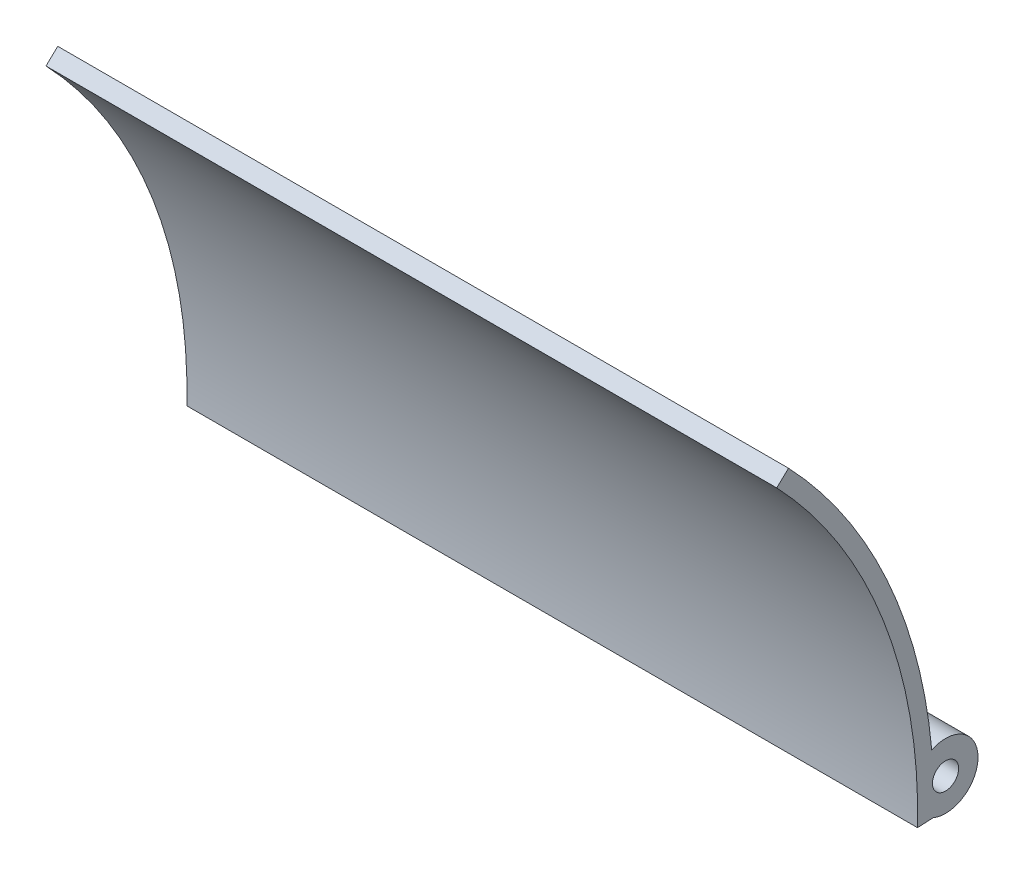
ISO-10303-21;
HEADER;
FILE_DESCRIPTION(('STEP AP214'),'2;1');
FILE_NAME('part.step','',(''),(''),'','','');
FILE_SCHEMA(('AUTOMOTIVE_DESIGN { 1 0 10303 214 1 1 1 1 }'));
ENDSEC;
DATA;
#1=APPLICATION_CONTEXT('core data for automotive mechanical design processes');
#2=APPLICATION_PROTOCOL_DEFINITION('international standard','automotive_design',2000,#1);
#3=PRODUCT_CONTEXT('',#1,'mechanical');
#4=PRODUCT('Part','Part','',(#3));
#5=PRODUCT_RELATED_PRODUCT_CATEGORY('part','',(#4));
#6=PRODUCT_DEFINITION_FORMATION('','',#4);
#7=PRODUCT_DEFINITION_CONTEXT('part definition',#1,'design');
#8=PRODUCT_DEFINITION('design','',#6,#7);
#9=PRODUCT_DEFINITION_SHAPE('','',#8);
#10=(LENGTH_UNIT() NAMED_UNIT(*) SI_UNIT(.MILLI.,.METRE.));
#11=(NAMED_UNIT(*) PLANE_ANGLE_UNIT() SI_UNIT($,.RADIAN.));
#12=(NAMED_UNIT(*) SI_UNIT($,.STERADIAN.) SOLID_ANGLE_UNIT());
#13=UNCERTAINTY_MEASURE_WITH_UNIT(LENGTH_MEASURE(1.E-05),#10,'distance_accuracy_value','');
#14=(GEOMETRIC_REPRESENTATION_CONTEXT(3) GLOBAL_UNCERTAINTY_ASSIGNED_CONTEXT((#13)) GLOBAL_UNIT_ASSIGNED_CONTEXT((#10,
#11,#12)) REPRESENTATION_CONTEXT('',''));
#15=CARTESIAN_POINT('',(0.,0.,0.));
#16=DIRECTION('',(0.,0.,1.));
#17=DIRECTION('',(1.,0.,0.));
#18=AXIS2_PLACEMENT_3D('',#15,#16,#17);
#19=CARTESIAN_POINT('',(180.,0.,0.));
#20=DIRECTION('',(1.,0.,0.));
#21=DIRECTION('',(0.,0.,-1.));
#22=AXIS2_PLACEMENT_3D('',#19,#20,#21);
#23=PLANE('',#22);
#24=CARTESIAN_POINT('',(180.,0.,0.));
#25=DIRECTION('',(-1.,0.,0.));
#26=DIRECTION('',(0.,0.,-1.));
#27=AXIS2_PLACEMENT_3D('',#24,#25,#26);
#28=CIRCLE('',#27,125.8);
#29=CARTESIAN_POINT('',(180.,86.7682376149053,-91.0873917795616));
#30=VERTEX_POINT('',#29);
#31=CARTESIAN_POINT('',(180.,-3.05410319881889,-125.762921617029));
#32=VERTEX_POINT('',#31);
#33=EDGE_CURVE('E124',#30,#32,#28,.T.);
#34=ORIENTED_EDGE('',*,*,#33,.T.);
#35=DIRECTION('',(0.,0.0502963955042818,-0.99873433534613));
#36=VECTOR('',#35,1.);
#37=CARTESIAN_POINT('',(180.,-3.05410319881889,-125.762921617029));
#38=LINE('',#37,#36);
#39=CARTESIAN_POINT('',(180.,-2.86003580146993,-129.616513333898));
#40=VERTEX_POINT('',#39);
#41=EDGE_CURVE('E89',#32,#40,#38,.T.);
#42=ORIENTED_EDGE('',*,*,#41,.T.);
#43=CARTESIAN_POINT('',(180.,4.53653399735667,-132.664587350566));
#44=DIRECTION('',(1.,0.,0.));
#45=DIRECTION('',(0.,0.,1.));
#46=AXIS2_PLACEMENT_3D('',#43,#44,#45);
#47=CIRCLE('',#46,8.);
#48=CARTESIAN_POINT('',(180.,11.7780516562191,-129.264525292841));
#49=VERTEX_POINT('',#48);
#50=EDGE_CURVE('E94',#40,#49,#47,.T.);
#51=ORIENTED_EDGE('',*,*,#50,.T.);
#52=CARTESIAN_POINT('',(180.,0.,0.));
#53=DIRECTION('',(1.,0.,0.));
#54=DIRECTION('',(0.,0.,-1.));
#55=AXIS2_PLACEMENT_3D('',#52,#53,#54);
#56=CIRCLE('',#55,129.8);
#57=CARTESIAN_POINT('',(180.,89.5271640891471,-93.9836522495));
#58=VERTEX_POINT('',#57);
#59=EDGE_CURVE('E98',#49,#58,#56,.T.);
#60=ORIENTED_EDGE('',*,*,#59,.T.);
#61=DIRECTION('',(0.,-0.689731618560452,0.724065117484594));
#62=VECTOR('',#61,1.);
#63=CARTESIAN_POINT('',(180.,86.7682376149053,-91.0873917795616));
#64=LINE('',#63,#62);
#65=EDGE_CURVE('E57',#58,#30,#64,.T.);
#66=ORIENTED_EDGE('',*,*,#65,.T.);
#67=EDGE_LOOP('',(#34,#42,#51,#60,#66));
#68=FACE_BOUND('',#67,.T.);
#69=CARTESIAN_POINT('',(180.,4.53653399735667,-132.664587350566));
#70=DIRECTION('',(1.,0.,0.));
#71=DIRECTION('',(0.,0.,-1.));
#72=AXIS2_PLACEMENT_3D('',#69,#70,#71);
#73=CIRCLE('',#72,3.225);
#74=CARTESIAN_POINT('',(180.,4.53653399735667,-135.889587350566));
#75=VERTEX_POINT('',#74);
#76=EDGE_CURVE('E119',#75,#75,#73,.T.);
#77=ORIENTED_EDGE('',*,*,#76,.F.);
#78=EDGE_LOOP('',(#77));
#79=FACE_BOUND('',#78,.T.);
#80=ADVANCED_FACE('F39',(#68,#79),#23,.T.);
#81=CARTESIAN_POINT('',(0.,0.,0.));
#82=DIRECTION('',(1.,0.,0.));
#83=DIRECTION('',(0.,0.,-1.));
#84=AXIS2_PLACEMENT_3D('',#81,#82,#83);
#85=PLANE('',#84);
#86=CARTESIAN_POINT('',(0.,0.,0.));
#87=DIRECTION('',(-1.,0.,0.));
#88=DIRECTION('',(0.,0.,-1.));
#89=AXIS2_PLACEMENT_3D('',#86,#87,#88);
#90=CIRCLE('',#89,125.8);
#91=CARTESIAN_POINT('',(0.,86.7682376149053,-91.0873917795616));
#92=VERTEX_POINT('',#91);
#93=CARTESIAN_POINT('',(0.,-3.05410319881889,-125.762921617029));
#94=VERTEX_POINT('',#93);
#95=EDGE_CURVE('E111',#92,#94,#90,.T.);
#96=ORIENTED_EDGE('',*,*,#95,.F.);
#97=DIRECTION('',(0.,-0.689731618560452,0.724065117484594));
#98=VECTOR('',#97,1.);
#99=CARTESIAN_POINT('',(0.,86.7682376149053,-91.0873917795616));
#100=LINE('',#99,#98);
#101=CARTESIAN_POINT('',(0.,89.5271640891471,-93.9836522495));
#102=VERTEX_POINT('',#101);
#103=EDGE_CURVE('E82',#102,#92,#100,.T.);
#104=ORIENTED_EDGE('',*,*,#103,.F.);
#105=CARTESIAN_POINT('',(0.,0.,0.));
#106=DIRECTION('',(1.,0.,0.));
#107=DIRECTION('',(0.,0.,-1.));
#108=AXIS2_PLACEMENT_3D('',#105,#106,#107);
#109=CIRCLE('',#108,129.8);
#110=CARTESIAN_POINT('',(0.,11.7780516562191,-129.264525292841));
#111=VERTEX_POINT('',#110);
#112=EDGE_CURVE('E77',#111,#102,#109,.T.);
#113=ORIENTED_EDGE('',*,*,#112,.F.);
#114=CARTESIAN_POINT('',(0.,4.53653399735667,-132.664587350566));
#115=DIRECTION('',(1.,0.,0.));
#116=DIRECTION('',(0.,0.,1.));
#117=AXIS2_PLACEMENT_3D('',#114,#115,#116);
#118=CIRCLE('',#117,8.);
#119=CARTESIAN_POINT('',(0.,-2.86003580146993,-129.616513333898));
#120=VERTEX_POINT('',#119);
#121=EDGE_CURVE('E104',#120,#111,#118,.T.);
#122=ORIENTED_EDGE('',*,*,#121,.F.);
#123=DIRECTION('',(0.,0.0502963955042818,-0.99873433534613));
#124=VECTOR('',#123,1.);
#125=CARTESIAN_POINT('',(0.,-3.05410319881889,-125.762921617029));
#126=LINE('',#125,#124);
#127=EDGE_CURVE('E120',#94,#120,#126,.T.);
#128=ORIENTED_EDGE('',*,*,#127,.F.);
#129=EDGE_LOOP('',(#96,#104,#113,#122,#128));
#130=FACE_BOUND('',#129,.T.);
#131=CARTESIAN_POINT('',(0.,4.53653399735667,-132.664587350566));
#132=DIRECTION('',(1.,0.,0.));
#133=DIRECTION('',(0.,0.,-1.));
#134=AXIS2_PLACEMENT_3D('',#131,#132,#133);
#135=CIRCLE('',#134,3.225);
#136=CARTESIAN_POINT('',(0.,4.53653399735667,-135.889587350566));
#137=VERTEX_POINT('',#136);
#138=EDGE_CURVE('E201',#137,#137,#135,.T.);
#139=ORIENTED_EDGE('',*,*,#138,.T.);
#140=EDGE_LOOP('',(#139));
#141=FACE_BOUND('',#140,.T.);
#142=ADVANCED_FACE('F130',(#130,#141),#85,.F.);
#143=CARTESIAN_POINT('',(180.,0.,0.));
#144=DIRECTION('',(-1.,0.,0.));
#145=DIRECTION('',(0.,0.,1.));
#146=AXIS2_PLACEMENT_3D('',#143,#144,#145);
#147=CYLINDRICAL_SURFACE('',#146,125.8);
#148=ORIENTED_EDGE('',*,*,#95,.T.);
#149=DIRECTION('',(-1.,0.,0.));
#150=VECTOR('',#149,1.);
#151=CARTESIAN_POINT('',(180.,-3.05410319881889,-125.762921617029));
#152=LINE('',#151,#150);
#153=EDGE_CURVE('E11',#32,#94,#152,.T.);
#154=ORIENTED_EDGE('',*,*,#153,.F.);
#155=ORIENTED_EDGE('',*,*,#33,.F.);
#156=DIRECTION('',(-1.,0.,0.));
#157=VECTOR('',#156,1.);
#158=CARTESIAN_POINT('',(180.,86.7682376149053,-91.0873917795616));
#159=LINE('',#158,#157);
#160=EDGE_CURVE('E109',#30,#92,#159,.T.);
#161=ORIENTED_EDGE('',*,*,#160,.T.);
#162=EDGE_LOOP('',(#148,#154,#155,#161));
#163=FACE_BOUND('',#162,.T.);
#164=ADVANCED_FACE('F41',(#163),#147,.F.);
#165=CARTESIAN_POINT('',(180.,-3.05410319881889,-125.762921617029));
#166=DIRECTION('',(0.,0.99873433534613,0.0502963955042818));
#167=DIRECTION('',(0.,-0.0502963955042818,0.998734335346131));
#168=AXIS2_PLACEMENT_3D('',#165,#166,#167);
#169=PLANE('',#168);
#170=ORIENTED_EDGE('',*,*,#127,.T.);
#171=DIRECTION('',(-1.,0.,0.));
#172=VECTOR('',#171,1.);
#173=CARTESIAN_POINT('',(180.,-2.86003580146993,-129.616513333898));
#174=LINE('',#173,#172);
#175=EDGE_CURVE('E48',#40,#120,#174,.T.);
#176=ORIENTED_EDGE('',*,*,#175,.F.);
#177=ORIENTED_EDGE('',*,*,#41,.F.);
#178=ORIENTED_EDGE('',*,*,#153,.T.);
#179=EDGE_LOOP('',(#170,#176,#177,#178));
#180=FACE_BOUND('',#179,.T.);
#181=ADVANCED_FACE('F155',(#180),#169,.F.);
#182=CARTESIAN_POINT('',(180.,4.53653399735667,-132.664587350566));
#183=DIRECTION('',(-1.,0.,0.));
#184=DIRECTION('',(0.,0.,1.));
#185=AXIS2_PLACEMENT_3D('',#182,#183,#184);
#186=CYLINDRICAL_SURFACE('',#185,8.);
#187=ORIENTED_EDGE('',*,*,#121,.T.);
#188=DIRECTION('',(-1.,0.,0.));
#189=VECTOR('',#188,1.);
#190=CARTESIAN_POINT('',(180.,11.7780516562191,-129.264525292841));
#191=LINE('',#190,#189);
#192=EDGE_CURVE('E105',#49,#111,#191,.T.);
#193=ORIENTED_EDGE('',*,*,#192,.F.);
#194=ORIENTED_EDGE('',*,*,#50,.F.);
#195=ORIENTED_EDGE('',*,*,#175,.T.);
#196=EDGE_LOOP('',(#187,#193,#194,#195));
#197=FACE_BOUND('',#196,.T.);
#198=ADVANCED_FACE('F103',(#197),#186,.T.);
#199=CARTESIAN_POINT('',(180.,0.,0.));
#200=DIRECTION('',(-1.,0.,0.));
#201=DIRECTION('',(0.,0.,1.));
#202=AXIS2_PLACEMENT_3D('',#199,#200,#201);
#203=CYLINDRICAL_SURFACE('',#202,129.8);
#204=ORIENTED_EDGE('',*,*,#112,.T.);
#205=DIRECTION('',(-1.,0.,0.));
#206=VECTOR('',#205,1.);
#207=CARTESIAN_POINT('',(180.,89.5271640891471,-93.9836522495));
#208=LINE('',#207,#206);
#209=EDGE_CURVE('E106',#58,#102,#208,.T.);
#210=ORIENTED_EDGE('',*,*,#209,.F.);
#211=ORIENTED_EDGE('',*,*,#59,.F.);
#212=ORIENTED_EDGE('',*,*,#192,.T.);
#213=EDGE_LOOP('',(#204,#210,#211,#212));
#214=FACE_BOUND('',#213,.T.);
#215=ADVANCED_FACE('F107',(#214),#203,.T.);
#216=CARTESIAN_POINT('',(180.,86.7682376149053,-91.0873917795616));
#217=DIRECTION('',(0.,-0.724065117484594,-0.689731618560452));
#218=DIRECTION('',(0.,0.689731618560452,-0.724065117484594));
#219=AXIS2_PLACEMENT_3D('',#216,#217,#218);
#220=PLANE('',#219);
#221=ORIENTED_EDGE('',*,*,#103,.T.);
#222=ORIENTED_EDGE('',*,*,#160,.F.);
#223=ORIENTED_EDGE('',*,*,#65,.F.);
#224=ORIENTED_EDGE('',*,*,#209,.T.);
#225=EDGE_LOOP('',(#221,#222,#223,#224));
#226=FACE_BOUND('',#225,.T.);
#227=ADVANCED_FACE('F135',(#226),#220,.F.);
#228=CARTESIAN_POINT('',(180.,4.53653399735667,-132.664587350566));
#229=DIRECTION('',(-1.,0.,0.));
#230=DIRECTION('',(0.,0.,1.));
#231=AXIS2_PLACEMENT_3D('',#228,#229,#230);
#232=CYLINDRICAL_SURFACE('',#231,3.225);
#233=ORIENTED_EDGE('',*,*,#76,.T.);
#234=EDGE_LOOP('',(#233));
#235=FACE_BOUND('',#234,.T.);
#236=ORIENTED_EDGE('',*,*,#138,.F.);
#237=EDGE_LOOP('',(#236));
#238=FACE_BOUND('',#237,.T.);
#239=ADVANCED_FACE('F131',(#235,#238),#232,.F.);
#240=CLOSED_SHELL('',(#80,#142,#164,#181,#198,#215,#227,#239));
#241=MANIFOLD_SOLID_BREP('B2',#240);
#242=ADVANCED_BREP_SHAPE_REPRESENTATION('',(#18,#241),#14);
#243=SHAPE_DEFINITION_REPRESENTATION(#9,#242);
ENDSEC;
END-ISO-10303-21;
